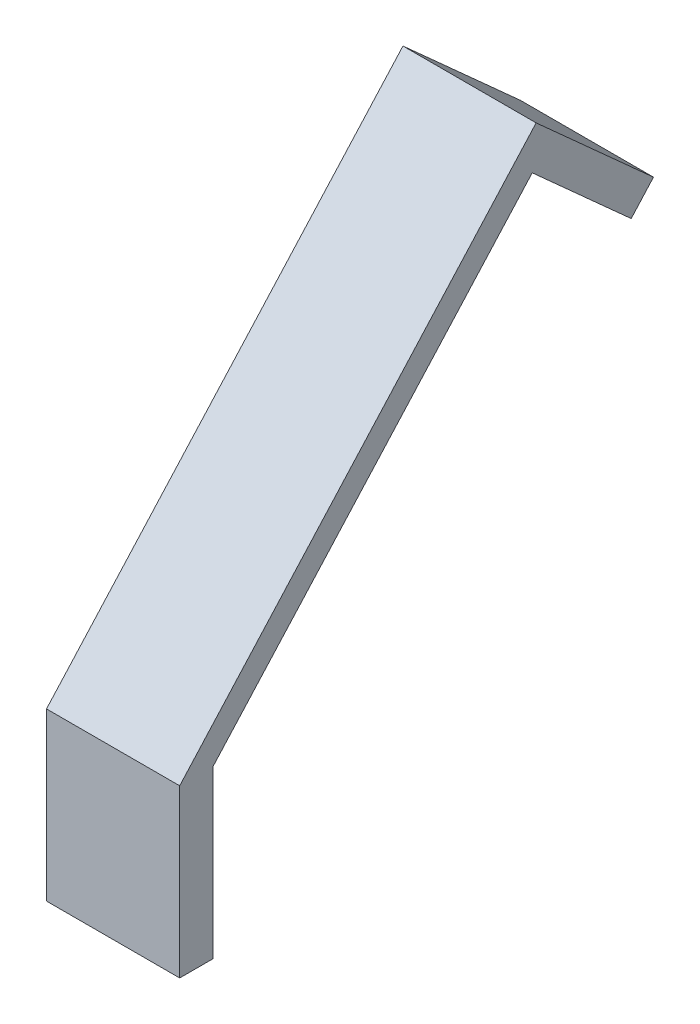
ISO-10303-21;
HEADER;
FILE_DESCRIPTION(('STEP AP214'),'2;1');
FILE_NAME('part.step','',(''),(''),'','','');
FILE_SCHEMA(('AUTOMOTIVE_DESIGN { 1 0 10303 214 1 1 1 1 }'));
ENDSEC;
DATA;
#1=APPLICATION_CONTEXT('core data for automotive mechanical design processes');
#2=APPLICATION_PROTOCOL_DEFINITION('international standard','automotive_design',2000,#1);
#3=PRODUCT_CONTEXT('',#1,'mechanical');
#4=PRODUCT('Part','Part','',(#3));
#5=PRODUCT_RELATED_PRODUCT_CATEGORY('part','',(#4));
#6=PRODUCT_DEFINITION_FORMATION('','',#4);
#7=PRODUCT_DEFINITION_CONTEXT('part definition',#1,'design');
#8=PRODUCT_DEFINITION('design','',#6,#7);
#9=PRODUCT_DEFINITION_SHAPE('','',#8);
#10=(LENGTH_UNIT() NAMED_UNIT(*) SI_UNIT(.MILLI.,.METRE.));
#11=(NAMED_UNIT(*) PLANE_ANGLE_UNIT() SI_UNIT($,.RADIAN.));
#12=(NAMED_UNIT(*) SI_UNIT($,.STERADIAN.) SOLID_ANGLE_UNIT());
#13=UNCERTAINTY_MEASURE_WITH_UNIT(LENGTH_MEASURE(1.E-05),#10,'distance_accuracy_value','');
#14=(GEOMETRIC_REPRESENTATION_CONTEXT(3) GLOBAL_UNCERTAINTY_ASSIGNED_CONTEXT((#13)) GLOBAL_UNIT_ASSIGNED_CONTEXT((#10,
#11,#12)) REPRESENTATION_CONTEXT('',''));
#15=CARTESIAN_POINT('',(0.,0.,0.));
#16=DIRECTION('',(0.,0.,1.));
#17=DIRECTION('',(1.,0.,0.));
#18=AXIS2_PLACEMENT_3D('',#15,#16,#17);
#19=CARTESIAN_POINT('',(50.8,22.1160072556631,24.5623144361929));
#20=DIRECTION('',(0.,-0.669130606358854,-0.743144825477398));
#21=DIRECTION('',(0.,0.743144825477398,-0.669130606358854));
#22=AXIS2_PLACEMENT_3D('',#19,#20,#21);
#23=PLANE('',#22);
#24=DIRECTION('',(0.,-0.743144825477398,0.669130606358854));
#25=VECTOR('',#24,1.);
#26=CARTESIAN_POINT('',(0.,22.1160072556631,24.5623144361929));
#27=LINE('',#26,#25);
#28=CARTESIAN_POINT('',(0.,198.753875217856,-134.483136253111));
#29=VERTEX_POINT('',#28);
#30=CARTESIAN_POINT('',(0.,63.5,-12.7));
#31=VERTEX_POINT('',#30);
#32=EDGE_CURVE('E145',#29,#31,#27,.T.);
#33=ORIENTED_EDGE('',*,*,#32,.F.);
#34=DIRECTION('',(-1.,0.,0.));
#35=VECTOR('',#34,1.);
#36=CARTESIAN_POINT('',(50.8,198.753875217856,-134.483136253111));
#37=LINE('',#36,#35);
#38=CARTESIAN_POINT('',(50.8,198.753875217856,-134.483136253111));
#39=VERTEX_POINT('',#38);
#40=EDGE_CURVE('E11',#39,#29,#37,.T.);
#41=ORIENTED_EDGE('',*,*,#40,.F.);
#42=DIRECTION('',(0.,-0.743144825477398,0.669130606358854));
#43=VECTOR('',#42,1.);
#44=CARTESIAN_POINT('',(50.8,22.1160072556631,24.5623144361929));
#45=LINE('',#44,#43);
#46=CARTESIAN_POINT('',(50.8,63.5,-12.7));
#47=VERTEX_POINT('',#46);
#48=EDGE_CURVE('E172',#39,#47,#45,.T.);
#49=ORIENTED_EDGE('',*,*,#48,.T.);
#50=DIRECTION('',(-1.,0.,0.));
#51=VECTOR('',#50,1.);
#52=CARTESIAN_POINT('',(50.8,63.5,-12.7));
#53=LINE('',#52,#51);
#54=EDGE_CURVE('E96',#47,#31,#53,.T.);
#55=ORIENTED_EDGE('',*,*,#54,.T.);
#56=EDGE_LOOP('',(#33,#41,#49,#55));
#57=FACE_BOUND('',#56,.T.);
#58=ADVANCED_FACE('F45',(#57),#23,.T.);
#59=CARTESIAN_POINT('',(50.8,176.637867962192,-159.045450689305));
#60=DIRECTION('',(0.,-0.743144825477395,0.669130606358857));
#61=DIRECTION('',(0.,-0.669130606358857,-0.743144825477395));
#62=AXIS2_PLACEMENT_3D('',#59,#60,#61);
#63=PLANE('',#62);
#64=DIRECTION('',(0.,0.669130606358857,0.743144825477395));
#65=VECTOR('',#64,1.);
#66=CARTESIAN_POINT('',(0.,176.637867962192,-159.045450689305));
#67=LINE('',#66,#65);
#68=CARTESIAN_POINT('',(0.,164.762040414826,-172.234893387363));
#69=VERTEX_POINT('',#68);
#70=EDGE_CURVE('E149',#69,#29,#67,.T.);
#71=ORIENTED_EDGE('',*,*,#70,.F.);
#72=DIRECTION('',(-1.,0.,0.));
#73=VECTOR('',#72,1.);
#74=CARTESIAN_POINT('',(50.8,164.762040414826,-172.234893387363));
#75=LINE('',#74,#73);
#76=CARTESIAN_POINT('',(50.8,164.762040414826,-172.234893387363));
#77=VERTEX_POINT('',#76);
#78=EDGE_CURVE('E54',#77,#69,#75,.T.);
#79=ORIENTED_EDGE('',*,*,#78,.F.);
#80=DIRECTION('',(0.,0.669130606358857,0.743144825477395));
#81=VECTOR('',#80,1.);
#82=CARTESIAN_POINT('',(50.8,176.637867962192,-159.045450689305));
#83=LINE('',#82,#81);
#84=EDGE_CURVE('E203',#77,#39,#83,.T.);
#85=ORIENTED_EDGE('',*,*,#84,.T.);
#86=ORIENTED_EDGE('',*,*,#40,.T.);
#87=EDGE_LOOP('',(#71,#79,#85,#86));
#88=FACE_BOUND('',#87,.T.);
#89=ADVANCED_FACE('F195',(#88),#63,.T.);
#90=CARTESIAN_POINT('',(50.8,-11.8758275473661,-13.1894426980582));
#91=DIRECTION('',(0.,-0.669130606358856,-0.743144825477396));
#92=DIRECTION('',(0.,0.743144825477396,-0.669130606358857));
#93=AXIS2_PLACEMENT_3D('',#90,#91,#92);
#94=PLANE('',#93);
#95=DIRECTION('',(0.,-0.743144825477396,0.669130606358857));
#96=VECTOR('',#95,1.);
#97=CARTESIAN_POINT('',(0.,-11.8758275473661,-13.1894426980582));
#98=LINE('',#97,#96);
#99=CARTESIAN_POINT('',(0.,174.199979698389,-180.73285208812));
#100=VERTEX_POINT('',#99);
#101=EDGE_CURVE('E153',#100,#69,#98,.T.);
#102=ORIENTED_EDGE('',*,*,#101,.F.);
#103=DIRECTION('',(-1.,0.,0.));
#104=VECTOR('',#103,1.);
#105=CARTESIAN_POINT('',(50.8,174.199979698389,-180.73285208812));
#106=LINE('',#105,#104);
#107=CARTESIAN_POINT('',(50.8,174.199979698389,-180.73285208812));
#108=VERTEX_POINT('',#107);
#109=EDGE_CURVE('E182',#108,#100,#106,.T.);
#110=ORIENTED_EDGE('',*,*,#109,.F.);
#111=DIRECTION('',(0.,-0.743144825477396,0.669130606358857));
#112=VECTOR('',#111,1.);
#113=CARTESIAN_POINT('',(50.8,-11.8758275473661,-13.1894426980582));
#114=LINE('',#113,#112);
#115=EDGE_CURVE('E191',#108,#77,#114,.T.);
#116=ORIENTED_EDGE('',*,*,#115,.T.);
#117=ORIENTED_EDGE('',*,*,#78,.T.);
#118=EDGE_LOOP('',(#102,#110,#116,#117));
#119=FACE_BOUND('',#118,.T.);
#120=ADVANCED_FACE('F189',(#119),#94,.T.);
#121=CARTESIAN_POINT('',(50.8,186.075807245755,-167.543409390062));
#122=DIRECTION('',(0.,0.743144825477395,-0.669130606358857));
#123=DIRECTION('',(0.,0.669130606358857,0.743144825477395));
#124=AXIS2_PLACEMENT_3D('',#121,#122,#123);
#125=PLANE('',#124);
#126=DIRECTION('',(0.,-0.669130606358857,-0.743144825477395));
#127=VECTOR('',#126,1.);
#128=CARTESIAN_POINT('',(0.,186.075807245755,-167.543409390062));
#129=LINE('',#128,#127);
#130=CARTESIAN_POINT('',(0.,214.507028537007,-135.967339212119));
#131=VERTEX_POINT('',#130);
#132=EDGE_CURVE('E157',#131,#100,#129,.T.);
#133=ORIENTED_EDGE('',*,*,#132,.F.);
#134=DIRECTION('',(-1.,0.,0.));
#135=VECTOR('',#134,1.);
#136=CARTESIAN_POINT('',(50.8,214.507028537007,-135.967339212119));
#137=LINE('',#136,#135);
#138=CARTESIAN_POINT('',(50.8,214.507028537007,-135.967339212119));
#139=VERTEX_POINT('',#138);
#140=EDGE_CURVE('E179',#139,#131,#137,.T.);
#141=ORIENTED_EDGE('',*,*,#140,.F.);
#142=DIRECTION('',(0.,-0.669130606358857,-0.743144825477395));
#143=VECTOR('',#142,1.);
#144=CARTESIAN_POINT('',(50.8,186.075807245755,-167.543409390062));
#145=LINE('',#144,#143);
#146=EDGE_CURVE('E139',#139,#108,#145,.T.);
#147=ORIENTED_EDGE('',*,*,#146,.T.);
#148=ORIENTED_EDGE('',*,*,#109,.T.);
#149=EDGE_LOOP('',(#133,#141,#147,#148));
#150=FACE_BOUND('',#149,.T.);
#151=ADVANCED_FACE('F201',(#150),#125,.T.);
#152=CARTESIAN_POINT('',(50.8,28.4312212912516,31.5760701779426));
#153=DIRECTION('',(0.,0.669130606358854,0.743144825477398));
#154=DIRECTION('',(0.,-0.743144825477398,0.669130606358854));
#155=AXIS2_PLACEMENT_3D('',#152,#153,#154);
#156=PLANE('',#155);
#157=DIRECTION('',(0.,0.743144825477398,-0.669130606358854));
#158=VECTOR('',#157,1.);
#159=CARTESIAN_POINT('',(0.,28.4312212912516,31.5760701779426));
#160=LINE('',#159,#158);
#161=CARTESIAN_POINT('',(0.,63.5,0.));
#162=VERTEX_POINT('',#161);
#163=EDGE_CURVE('E161',#162,#131,#160,.T.);
#164=ORIENTED_EDGE('',*,*,#163,.F.);
#165=DIRECTION('',(-1.,0.,0.));
#166=VECTOR('',#165,1.);
#167=CARTESIAN_POINT('',(50.8,63.5,0.));
#168=LINE('',#167,#166);
#169=CARTESIAN_POINT('',(50.8,63.5,0.));
#170=VERTEX_POINT('',#169);
#171=EDGE_CURVE('E124',#170,#162,#168,.T.);
#172=ORIENTED_EDGE('',*,*,#171,.F.);
#173=DIRECTION('',(0.,0.743144825477398,-0.669130606358854));
#174=VECTOR('',#173,1.);
#175=CARTESIAN_POINT('',(50.8,28.4312212912516,31.5760701779426));
#176=LINE('',#175,#174);
#177=EDGE_CURVE('E135',#170,#139,#176,.T.);
#178=ORIENTED_EDGE('',*,*,#177,.T.);
#179=ORIENTED_EDGE('',*,*,#140,.T.);
#180=EDGE_LOOP('',(#164,#172,#178,#179));
#181=FACE_BOUND('',#180,.T.);
#182=ADVANCED_FACE('F222',(#181),#156,.T.);
#183=CARTESIAN_POINT('',(50.8,0.,0.));
#184=DIRECTION('',(0.,0.,1.));
#185=DIRECTION('',(1.,0.,0.));
#186=AXIS2_PLACEMENT_3D('',#183,#184,#185);
#187=PLANE('',#186);
#188=DIRECTION('',(0.,1.,0.));
#189=VECTOR('',#188,1.);
#190=CARTESIAN_POINT('',(0.,0.,0.));
#191=LINE('',#190,#189);
#192=CARTESIAN_POINT('',(0.,0.,0.));
#193=VERTEX_POINT('',#192);
#194=EDGE_CURVE('E122',#193,#162,#191,.T.);
#195=ORIENTED_EDGE('',*,*,#194,.F.);
#196=DIRECTION('',(-1.,0.,0.));
#197=VECTOR('',#196,1.);
#198=CARTESIAN_POINT('',(50.8,0.,0.));
#199=LINE('',#198,#197);
#200=CARTESIAN_POINT('',(50.8,0.,0.));
#201=VERTEX_POINT('',#200);
#202=EDGE_CURVE('E116',#201,#193,#199,.T.);
#203=ORIENTED_EDGE('',*,*,#202,.F.);
#204=DIRECTION('',(0.,1.,0.));
#205=VECTOR('',#204,1.);
#206=CARTESIAN_POINT('',(50.8,0.,0.));
#207=LINE('',#206,#205);
#208=EDGE_CURVE('E120',#201,#170,#207,.T.);
#209=ORIENTED_EDGE('',*,*,#208,.T.);
#210=ORIENTED_EDGE('',*,*,#171,.T.);
#211=EDGE_LOOP('',(#195,#203,#209,#210));
#212=FACE_BOUND('',#211,.T.);
#213=ADVANCED_FACE('F118',(#212),#187,.T.);
#214=CARTESIAN_POINT('',(50.8,0.,0.));
#215=DIRECTION('',(0.,1.,0.));
#216=DIRECTION('',(0.,0.,1.));
#217=AXIS2_PLACEMENT_3D('',#214,#215,#216);
#218=PLANE('',#217);
#219=DIRECTION('',(0.,0.,-1.));
#220=VECTOR('',#219,1.);
#221=CARTESIAN_POINT('',(0.,0.,0.));
#222=LINE('',#221,#220);
#223=CARTESIAN_POINT('',(0.,0.,-12.7));
#224=VERTEX_POINT('',#223);
#225=EDGE_CURVE('E89',#193,#224,#222,.T.);
#226=ORIENTED_EDGE('',*,*,#225,.T.);
#227=DIRECTION('',(-1.,0.,0.));
#228=VECTOR('',#227,1.);
#229=CARTESIAN_POINT('',(50.8,0.,-12.7));
#230=LINE('',#229,#228);
#231=CARTESIAN_POINT('',(50.8,0.,-12.7));
#232=VERTEX_POINT('',#231);
#233=EDGE_CURVE('E125',#232,#224,#230,.T.);
#234=ORIENTED_EDGE('',*,*,#233,.F.);
#235=DIRECTION('',(0.,0.,-1.));
#236=VECTOR('',#235,1.);
#237=CARTESIAN_POINT('',(50.8,0.,0.));
#238=LINE('',#237,#236);
#239=EDGE_CURVE('E127',#201,#232,#238,.T.);
#240=ORIENTED_EDGE('',*,*,#239,.F.);
#241=ORIENTED_EDGE('',*,*,#202,.T.);
#242=EDGE_LOOP('',(#226,#234,#240,#241));
#243=FACE_BOUND('',#242,.T.);
#244=ADVANCED_FACE('F128',(#243),#218,.F.);
#245=CARTESIAN_POINT('',(50.8,0.,-12.7));
#246=DIRECTION('',(0.,0.,1.));
#247=DIRECTION('',(0.,-1.,0.));
#248=AXIS2_PLACEMENT_3D('',#245,#246,#247);
#249=PLANE('',#248);
#250=DIRECTION('',(0.,1.,0.));
#251=VECTOR('',#250,1.);
#252=CARTESIAN_POINT('',(0.,0.,-12.7));
#253=LINE('',#252,#251);
#254=EDGE_CURVE('E169',#224,#31,#253,.T.);
#255=ORIENTED_EDGE('',*,*,#254,.T.);
#256=ORIENTED_EDGE('',*,*,#54,.F.);
#257=DIRECTION('',(0.,1.,0.));
#258=VECTOR('',#257,1.);
#259=CARTESIAN_POINT('',(50.8,0.,-12.7));
#260=LINE('',#259,#258);
#261=EDGE_CURVE('E62',#232,#47,#260,.T.);
#262=ORIENTED_EDGE('',*,*,#261,.F.);
#263=ORIENTED_EDGE('',*,*,#233,.T.);
#264=EDGE_LOOP('',(#255,#256,#262,#263));
#265=FACE_BOUND('',#264,.T.);
#266=ADVANCED_FACE('F230',(#265),#249,.F.);
#267=CARTESIAN_POINT('',(50.8,0.,0.));
#268=DIRECTION('',(1.,0.,0.));
#269=DIRECTION('',(0.,0.,-1.));
#270=AXIS2_PLACEMENT_3D('',#267,#268,#269);
#271=PLANE('',#270);
#272=ORIENTED_EDGE('',*,*,#48,.F.);
#273=ORIENTED_EDGE('',*,*,#84,.F.);
#274=ORIENTED_EDGE('',*,*,#115,.F.);
#275=ORIENTED_EDGE('',*,*,#146,.F.);
#276=ORIENTED_EDGE('',*,*,#177,.F.);
#277=ORIENTED_EDGE('',*,*,#208,.F.);
#278=ORIENTED_EDGE('',*,*,#239,.T.);
#279=ORIENTED_EDGE('',*,*,#261,.T.);
#280=EDGE_LOOP('',(#272,#273,#274,#275,#276,#277,#278,#279));
#281=FACE_BOUND('',#280,.T.);
#282=ADVANCED_FACE('F132',(#281),#271,.T.);
#283=CARTESIAN_POINT('',(0.,0.,0.));
#284=DIRECTION('',(1.,0.,0.));
#285=DIRECTION('',(0.,0.,-1.));
#286=AXIS2_PLACEMENT_3D('',#283,#284,#285);
#287=PLANE('',#286);
#288=ORIENTED_EDGE('',*,*,#32,.T.);
#289=ORIENTED_EDGE('',*,*,#254,.F.);
#290=ORIENTED_EDGE('',*,*,#225,.F.);
#291=ORIENTED_EDGE('',*,*,#194,.T.);
#292=ORIENTED_EDGE('',*,*,#163,.T.);
#293=ORIENTED_EDGE('',*,*,#132,.T.);
#294=ORIENTED_EDGE('',*,*,#101,.T.);
#295=ORIENTED_EDGE('',*,*,#70,.T.);
#296=EDGE_LOOP('',(#288,#289,#290,#291,#292,#293,#294,#295));
#297=FACE_BOUND('',#296,.T.);
#298=ADVANCED_FACE('F197',(#297),#287,.F.);
#299=CLOSED_SHELL('',(#58,#89,#120,#151,#182,#213,#244,#266,#282,#298));
#300=MANIFOLD_SOLID_BREP('B2',#299);
#301=ADVANCED_BREP_SHAPE_REPRESENTATION('',(#18,#300),#14);
#302=SHAPE_DEFINITION_REPRESENTATION(#9,#301);
ENDSEC;
END-ISO-10303-21;
